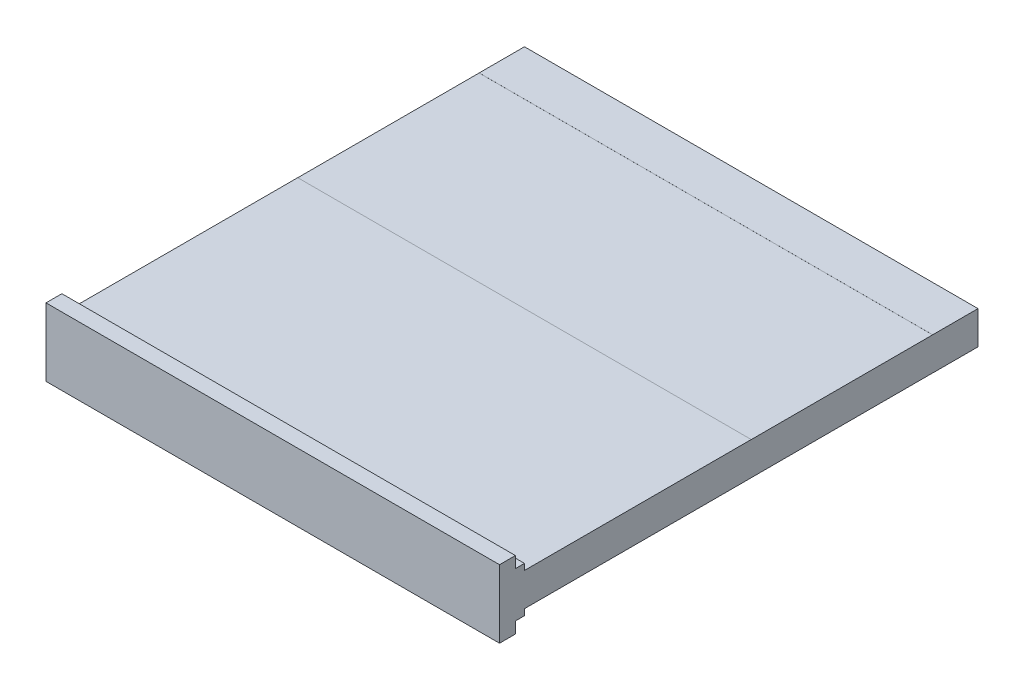
ISO-10303-21;
HEADER;
FILE_DESCRIPTION(('STEP AP214'),'2;1');
FILE_NAME('part.step','',(''),(''),'','','');
FILE_SCHEMA(('AUTOMOTIVE_DESIGN { 1 0 10303 214 1 1 1 1 }'));
ENDSEC;
DATA;
#1=APPLICATION_CONTEXT('core data for automotive mechanical design processes');
#2=APPLICATION_PROTOCOL_DEFINITION('international standard','automotive_design',2000,#1);
#3=PRODUCT_CONTEXT('',#1,'mechanical');
#4=PRODUCT('Part','Part','',(#3));
#5=PRODUCT_RELATED_PRODUCT_CATEGORY('part','',(#4));
#6=PRODUCT_DEFINITION_FORMATION('','',#4);
#7=PRODUCT_DEFINITION_CONTEXT('part definition',#1,'design');
#8=PRODUCT_DEFINITION('design','',#6,#7);
#9=PRODUCT_DEFINITION_SHAPE('','',#8);
#10=(LENGTH_UNIT() NAMED_UNIT(*) SI_UNIT(.MILLI.,.METRE.));
#11=(NAMED_UNIT(*) PLANE_ANGLE_UNIT() SI_UNIT($,.RADIAN.));
#12=(NAMED_UNIT(*) SI_UNIT($,.STERADIAN.) SOLID_ANGLE_UNIT());
#13=UNCERTAINTY_MEASURE_WITH_UNIT(LENGTH_MEASURE(1.E-05),#10,'distance_accuracy_value','');
#14=(GEOMETRIC_REPRESENTATION_CONTEXT(3) GLOBAL_UNCERTAINTY_ASSIGNED_CONTEXT((#13)) GLOBAL_UNIT_ASSIGNED_CONTEXT((#10,
#11,#12)) REPRESENTATION_CONTEXT('',''));
#15=CARTESIAN_POINT('',(0.,0.,0.));
#16=DIRECTION('',(0.,0.,1.));
#17=DIRECTION('',(1.,0.,0.));
#18=AXIS2_PLACEMENT_3D('',#15,#16,#17);
#19=CARTESIAN_POINT('',(0.,0.072865,1.));
#20=DIRECTION('',(0.,1.,0.));
#21=DIRECTION('',(0.,0.,1.));
#22=AXIS2_PLACEMENT_3D('',#19,#20,#21);
#23=PLANE('',#22);
#24=DIRECTION('',(0.,0.,-1.));
#25=VECTOR('',#24,1.);
#26=CARTESIAN_POINT('',(0.,0.072865,1.));
#27=LINE('',#26,#25);
#28=CARTESIAN_POINT('',(0.,0.072865,0.5));
#29=VERTEX_POINT('',#28);
#30=CARTESIAN_POINT('',(0.,0.072865,0.1));
#31=VERTEX_POINT('',#30);
#32=EDGE_CURVE('E43',#29,#31,#27,.T.);
#33=ORIENTED_EDGE('',*,*,#32,.F.);
#34=DIRECTION('',(-1.,0.,0.));
#35=VECTOR('',#34,1.);
#36=CARTESIAN_POINT('',(1.,0.072865,0.5));
#37=LINE('',#36,#35);
#38=CARTESIAN_POINT('',(1.,0.072865,0.5));
#39=VERTEX_POINT('',#38);
#40=EDGE_CURVE('E194',#39,#29,#37,.T.);
#41=ORIENTED_EDGE('',*,*,#40,.F.);
#42=DIRECTION('',(0.,0.,-1.));
#43=VECTOR('',#42,1.);
#44=CARTESIAN_POINT('',(1.,0.072865,1.));
#45=LINE('',#44,#43);
#46=CARTESIAN_POINT('',(1.,0.072865,0.1));
#47=VERTEX_POINT('',#46);
#48=EDGE_CURVE('E199',#39,#47,#45,.T.);
#49=ORIENTED_EDGE('',*,*,#48,.T.);
#50=DIRECTION('',(1.,0.,0.));
#51=VECTOR('',#50,1.);
#52=CARTESIAN_POINT('',(1.,0.072865,0.1));
#53=LINE('',#52,#51);
#54=EDGE_CURVE('E201',#31,#47,#53,.T.);
#55=ORIENTED_EDGE('',*,*,#54,.F.);
#56=EDGE_LOOP('',(#33,#41,#49,#55));
#57=FACE_BOUND('',#56,.T.);
#58=ADVANCED_FACE('F39',(#57),#23,.T.);
#59=CARTESIAN_POINT('',(0.,0.,1.));
#60=DIRECTION('',(0.,1.,0.));
#61=DIRECTION('',(0.,0.,1.));
#62=AXIS2_PLACEMENT_3D('',#59,#60,#61);
#63=PLANE('',#62);
#64=DIRECTION('',(1.,0.,0.));
#65=VECTOR('',#64,1.);
#66=CARTESIAN_POINT('',(0.,0.,0.5));
#67=LINE('',#66,#65);
#68=CARTESIAN_POINT('',(0.,0.,0.5));
#69=VERTEX_POINT('',#68);
#70=CARTESIAN_POINT('',(1.,0.,0.5));
#71=VERTEX_POINT('',#70);
#72=EDGE_CURVE('E231',#69,#71,#67,.T.);
#73=ORIENTED_EDGE('',*,*,#72,.F.);
#74=DIRECTION('',(0.,0.,-1.));
#75=VECTOR('',#74,1.);
#76=CARTESIAN_POINT('',(0.,0.,1.));
#77=LINE('',#76,#75);
#78=CARTESIAN_POINT('',(0.,0.,0.1));
#79=VERTEX_POINT('',#78);
#80=EDGE_CURVE('E11',#69,#79,#77,.T.);
#81=ORIENTED_EDGE('',*,*,#80,.T.);
#82=DIRECTION('',(-1.,0.,0.));
#83=VECTOR('',#82,1.);
#84=CARTESIAN_POINT('',(0.,0.,0.1));
#85=LINE('',#84,#83);
#86=CARTESIAN_POINT('',(1.,0.,0.1));
#87=VERTEX_POINT('',#86);
#88=EDGE_CURVE('E253',#87,#79,#85,.T.);
#89=ORIENTED_EDGE('',*,*,#88,.F.);
#90=DIRECTION('',(0.,0.,-1.));
#91=VECTOR('',#90,1.);
#92=CARTESIAN_POINT('',(1.,0.,1.));
#93=LINE('',#92,#91);
#94=EDGE_CURVE('E49',#71,#87,#93,.T.);
#95=ORIENTED_EDGE('',*,*,#94,.F.);
#96=EDGE_LOOP('',(#73,#81,#89,#95));
#97=FACE_BOUND('',#96,.T.);
#98=ADVANCED_FACE('F384',(#97),#63,.F.);
#99=CARTESIAN_POINT('',(0.,0.,1.));
#100=DIRECTION('',(-1.,0.,0.));
#101=DIRECTION('',(0.,0.,1.));
#102=AXIS2_PLACEMENT_3D('',#99,#100,#101);
#103=PLANE('',#102);
#104=DIRECTION('',(0.,-1.,0.));
#105=VECTOR('',#104,1.);
#106=CARTESIAN_POINT('',(0.,0.072965,0.5));
#107=LINE('',#106,#105);
#108=CARTESIAN_POINT('',(0.,0.072965,0.5));
#109=VERTEX_POINT('',#108);
#110=EDGE_CURVE('E184',#109,#29,#107,.T.);
#111=ORIENTED_EDGE('',*,*,#110,.T.);
#112=ORIENTED_EDGE('',*,*,#32,.T.);
#113=DIRECTION('',(0.,-1.,0.));
#114=VECTOR('',#113,1.);
#115=CARTESIAN_POINT('',(0.,0.072965,0.1));
#116=LINE('',#115,#114);
#117=CARTESIAN_POINT('',(0.,0.072965,0.1));
#118=VERTEX_POINT('',#117);
#119=EDGE_CURVE('E227',#118,#31,#116,.T.);
#120=ORIENTED_EDGE('',*,*,#119,.F.);
#121=DIRECTION('',(0.,0.,1.));
#122=VECTOR('',#121,1.);
#123=CARTESIAN_POINT('',(0.,0.072965,0.));
#124=LINE('',#123,#122);
#125=CARTESIAN_POINT('',(0.,0.072965,0.));
#126=VERTEX_POINT('',#125);
#127=EDGE_CURVE('E218',#126,#118,#124,.T.);
#128=ORIENTED_EDGE('',*,*,#127,.F.);
#129=DIRECTION('',(0.,1.,0.));
#130=VECTOR('',#129,1.);
#131=CARTESIAN_POINT('',(0.,0.,0.));
#132=LINE('',#131,#130);
#133=CARTESIAN_POINT('',(0.,-0.0001,0.));
#134=VERTEX_POINT('',#133);
#135=EDGE_CURVE('E364',#134,#126,#132,.T.);
#136=ORIENTED_EDGE('',*,*,#135,.F.);
#137=DIRECTION('',(0.,0.,-1.));
#138=VECTOR('',#137,1.);
#139=CARTESIAN_POINT('',(0.,-0.0001,0.));
#140=LINE('',#139,#138);
#141=CARTESIAN_POINT('',(0.,-0.0001,0.1));
#142=VERTEX_POINT('',#141);
#143=EDGE_CURVE('E254',#142,#134,#140,.T.);
#144=ORIENTED_EDGE('',*,*,#143,.F.);
#145=DIRECTION('',(0.,1.,0.));
#146=VECTOR('',#145,1.);
#147=CARTESIAN_POINT('',(0.,-0.0001,0.1));
#148=LINE('',#147,#146);
#149=EDGE_CURVE('E268',#142,#79,#148,.T.);
#150=ORIENTED_EDGE('',*,*,#149,.T.);
#151=ORIENTED_EDGE('',*,*,#80,.F.);
#152=DIRECTION('',(0.,1.,0.));
#153=VECTOR('',#152,1.);
#154=CARTESIAN_POINT('',(0.,-0.0001,0.5));
#155=LINE('',#154,#153);
#156=CARTESIAN_POINT('',(0.,-0.0001,0.5));
#157=VERTEX_POINT('',#156);
#158=EDGE_CURVE('E250',#157,#69,#155,.T.);
#159=ORIENTED_EDGE('',*,*,#158,.F.);
#160=DIRECTION('',(0.,0.,-1.));
#161=VECTOR('',#160,1.);
#162=CARTESIAN_POINT('',(0.,-0.0001,1.));
#163=LINE('',#162,#161);
#164=CARTESIAN_POINT('',(0.,-0.0001,1.));
#165=VERTEX_POINT('',#164);
#166=EDGE_CURVE('E232',#165,#157,#163,.T.);
#167=ORIENTED_EDGE('',*,*,#166,.F.);
#168=DIRECTION('',(0.,-1.,0.));
#169=VECTOR('',#168,1.);
#170=CARTESIAN_POINT('',(0.,0.0864325,1.));
#171=LINE('',#170,#169);
#172=CARTESIAN_POINT('',(0.,-0.0135675,1.));
#173=VERTEX_POINT('',#172);
#174=EDGE_CURVE('E324',#165,#173,#171,.T.);
#175=ORIENTED_EDGE('',*,*,#174,.T.);
#176=DIRECTION('',(0.,0.,-1.));
#177=VECTOR('',#176,1.);
#178=CARTESIAN_POINT('',(0.,-0.0135675,1.02));
#179=LINE('',#178,#177);
#180=CARTESIAN_POINT('',(0.,-0.0135675,1.02));
#181=VERTEX_POINT('',#180);
#182=EDGE_CURVE('E360',#181,#173,#179,.T.);
#183=ORIENTED_EDGE('',*,*,#182,.F.);
#184=DIRECTION('',(0.,-1.,0.));
#185=VECTOR('',#184,1.);
#186=CARTESIAN_POINT('',(0.,0.1114325,1.02));
#187=LINE('',#186,#185);
#188=CARTESIAN_POINT('',(0.,-0.0385675,1.02));
#189=VERTEX_POINT('',#188);
#190=EDGE_CURVE('E279',#181,#189,#187,.T.);
#191=ORIENTED_EDGE('',*,*,#190,.T.);
#192=DIRECTION('',(0.,0.,-1.));
#193=VECTOR('',#192,1.);
#194=CARTESIAN_POINT('',(0.,-0.0385675,1.055));
#195=LINE('',#194,#193);
#196=CARTESIAN_POINT('',(0.,-0.0385675,1.055));
#197=VERTEX_POINT('',#196);
#198=EDGE_CURVE('E320',#197,#189,#195,.T.);
#199=ORIENTED_EDGE('',*,*,#198,.F.);
#200=DIRECTION('',(0.,-1.,0.));
#201=VECTOR('',#200,1.);
#202=CARTESIAN_POINT('',(0.,0.1114325,1.055));
#203=LINE('',#202,#201);
#204=CARTESIAN_POINT('',(0.,0.1114325,1.055));
#205=VERTEX_POINT('',#204);
#206=EDGE_CURVE('E280',#205,#197,#203,.T.);
#207=ORIENTED_EDGE('',*,*,#206,.F.);
#208=DIRECTION('',(0.,0.,-1.));
#209=VECTOR('',#208,1.);
#210=CARTESIAN_POINT('',(0.,0.1114325,1.055));
#211=LINE('',#210,#209);
#212=CARTESIAN_POINT('',(0.,0.1114325,1.02));
#213=VERTEX_POINT('',#212);
#214=EDGE_CURVE('E294',#205,#213,#211,.T.);
#215=ORIENTED_EDGE('',*,*,#214,.T.);
#216=CARTESIAN_POINT('',(0.,0.0864325000000001,1.02));
#217=VERTEX_POINT('',#216);
#218=EDGE_CURVE('E295',#213,#217,#187,.T.);
#219=ORIENTED_EDGE('',*,*,#218,.T.);
#220=DIRECTION('',(0.,0.,-1.));
#221=VECTOR('',#220,1.);
#222=CARTESIAN_POINT('',(0.,0.0864325,1.02));
#223=LINE('',#222,#221);
#224=CARTESIAN_POINT('',(0.,0.0864325,1.));
#225=VERTEX_POINT('',#224);
#226=EDGE_CURVE('E334',#217,#225,#223,.T.);
#227=ORIENTED_EDGE('',*,*,#226,.T.);
#228=CARTESIAN_POINT('',(0.,0.072965,1.));
#229=VERTEX_POINT('',#228);
#230=EDGE_CURVE('E335',#225,#229,#171,.T.);
#231=ORIENTED_EDGE('',*,*,#230,.T.);
#232=DIRECTION('',(0.,0.,1.));
#233=VECTOR('',#232,1.);
#234=CARTESIAN_POINT('',(0.,0.072965,1.));
#235=LINE('',#234,#233);
#236=EDGE_CURVE('E57',#109,#229,#235,.T.);
#237=ORIENTED_EDGE('',*,*,#236,.F.);
#238=EDGE_LOOP('',(#111,#112,#120,#128,#136,#144,#150,#151,#159,#167,#175,#183,#191,#199,#207,
#215,#219,#227,#231,#237));
#239=FACE_BOUND('',#238,.T.);
#240=ADVANCED_FACE('F41',(#239),#103,.T.);
#241=CARTESIAN_POINT('',(1.,0.,1.));
#242=DIRECTION('',(-1.,0.,0.));
#243=DIRECTION('',(0.,0.,1.));
#244=AXIS2_PLACEMENT_3D('',#241,#242,#243);
#245=PLANE('',#244);
#246=ORIENTED_EDGE('',*,*,#48,.F.);
#247=DIRECTION('',(0.,-1.,0.));
#248=VECTOR('',#247,1.);
#249=CARTESIAN_POINT('',(1.,0.072965,0.5));
#250=LINE('',#249,#248);
#251=CARTESIAN_POINT('',(1.,0.072965,0.5));
#252=VERTEX_POINT('',#251);
#253=EDGE_CURVE('E181',#252,#39,#250,.T.);
#254=ORIENTED_EDGE('',*,*,#253,.F.);
#255=DIRECTION('',(0.,0.,-1.));
#256=VECTOR('',#255,1.);
#257=CARTESIAN_POINT('',(1.,0.072965,1.));
#258=LINE('',#257,#256);
#259=CARTESIAN_POINT('',(1.,0.072965,1.));
#260=VERTEX_POINT('',#259);
#261=EDGE_CURVE('E186',#260,#252,#258,.T.);
#262=ORIENTED_EDGE('',*,*,#261,.F.);
#263=DIRECTION('',(0.,1.,0.));
#264=VECTOR('',#263,1.);
#265=CARTESIAN_POINT('',(1.,0.0864325000000001,1.));
#266=LINE('',#265,#264);
#267=CARTESIAN_POINT('',(1.,0.0864325000000001,1.));
#268=VERTEX_POINT('',#267);
#269=EDGE_CURVE('E342',#260,#268,#266,.T.);
#270=ORIENTED_EDGE('',*,*,#269,.T.);
#271=DIRECTION('',(0.,0.,-1.));
#272=VECTOR('',#271,1.);
#273=CARTESIAN_POINT('',(1.,0.0864325000000001,1.02));
#274=LINE('',#273,#272);
#275=CARTESIAN_POINT('',(1.,0.0864325000000001,1.02));
#276=VERTEX_POINT('',#275);
#277=EDGE_CURVE('E352',#276,#268,#274,.T.);
#278=ORIENTED_EDGE('',*,*,#277,.F.);
#279=DIRECTION('',(0.,1.,0.));
#280=VECTOR('',#279,1.);
#281=CARTESIAN_POINT('',(1.,0.1114325,1.02));
#282=LINE('',#281,#280);
#283=CARTESIAN_POINT('',(1.,0.1114325,1.02));
#284=VERTEX_POINT('',#283);
#285=EDGE_CURVE('E302',#276,#284,#282,.T.);
#286=ORIENTED_EDGE('',*,*,#285,.T.);
#287=DIRECTION('',(0.,0.,-1.));
#288=VECTOR('',#287,1.);
#289=CARTESIAN_POINT('',(1.,0.1114325,1.055));
#290=LINE('',#289,#288);
#291=CARTESIAN_POINT('',(1.,0.1114325,1.055));
#292=VERTEX_POINT('',#291);
#293=EDGE_CURVE('E312',#292,#284,#290,.T.);
#294=ORIENTED_EDGE('',*,*,#293,.F.);
#295=DIRECTION('',(0.,1.,0.));
#296=VECTOR('',#295,1.);
#297=CARTESIAN_POINT('',(1.,0.1114325,1.055));
#298=LINE('',#297,#296);
#299=CARTESIAN_POINT('',(1.,-0.0385675,1.055));
#300=VERTEX_POINT('',#299);
#301=EDGE_CURVE('E288',#300,#292,#298,.T.);
#302=ORIENTED_EDGE('',*,*,#301,.F.);
#303=DIRECTION('',(0.,0.,-1.));
#304=VECTOR('',#303,1.);
#305=CARTESIAN_POINT('',(1.,-0.0385675,1.055));
#306=LINE('',#305,#304);
#307=CARTESIAN_POINT('',(1.,-0.0385675,1.02));
#308=VERTEX_POINT('',#307);
#309=EDGE_CURVE('E316',#300,#308,#306,.T.);
#310=ORIENTED_EDGE('',*,*,#309,.T.);
#311=CARTESIAN_POINT('',(1.,-0.0135674999999999,1.02));
#312=VERTEX_POINT('',#311);
#313=EDGE_CURVE('E303',#308,#312,#282,.T.);
#314=ORIENTED_EDGE('',*,*,#313,.T.);
#315=DIRECTION('',(0.,0.,-1.));
#316=VECTOR('',#315,1.);
#317=CARTESIAN_POINT('',(1.,-0.0135674999999999,1.02));
#318=LINE('',#317,#316);
#319=CARTESIAN_POINT('',(1.,-0.0135674999999999,1.));
#320=VERTEX_POINT('',#319);
#321=EDGE_CURVE('E356',#312,#320,#318,.T.);
#322=ORIENTED_EDGE('',*,*,#321,.T.);
#323=CARTESIAN_POINT('',(1.,-0.000100000000000002,1.));
#324=VERTEX_POINT('',#323);
#325=EDGE_CURVE('E343',#320,#324,#266,.T.);
#326=ORIENTED_EDGE('',*,*,#325,.T.);
#327=DIRECTION('',(0.,0.,1.));
#328=VECTOR('',#327,1.);
#329=CARTESIAN_POINT('',(1.,-0.0001,1.));
#330=LINE('',#329,#328);
#331=CARTESIAN_POINT('',(1.,-0.0001,0.5));
#332=VERTEX_POINT('',#331);
#333=EDGE_CURVE('E65',#332,#324,#330,.T.);
#334=ORIENTED_EDGE('',*,*,#333,.F.);
#335=DIRECTION('',(0.,1.,0.));
#336=VECTOR('',#335,1.);
#337=CARTESIAN_POINT('',(1.,-0.0001,0.5));
#338=LINE('',#337,#336);
#339=EDGE_CURVE('E244',#332,#71,#338,.T.);
#340=ORIENTED_EDGE('',*,*,#339,.T.);
#341=ORIENTED_EDGE('',*,*,#94,.T.);
#342=DIRECTION('',(0.,1.,0.));
#343=VECTOR('',#342,1.);
#344=CARTESIAN_POINT('',(1.,-0.0001,0.1));
#345=LINE('',#344,#343);
#346=CARTESIAN_POINT('',(1.,-0.0001,0.1));
#347=VERTEX_POINT('',#346);
#348=EDGE_CURVE('E275',#347,#87,#345,.T.);
#349=ORIENTED_EDGE('',*,*,#348,.F.);
#350=DIRECTION('',(0.,0.,1.));
#351=VECTOR('',#350,1.);
#352=CARTESIAN_POINT('',(1.,-0.0001,0.));
#353=LINE('',#352,#351);
#354=CARTESIAN_POINT('',(1.,-0.0001,0.));
#355=VERTEX_POINT('',#354);
#356=EDGE_CURVE('E262',#355,#347,#353,.T.);
#357=ORIENTED_EDGE('',*,*,#356,.F.);
#358=DIRECTION('',(0.,1.,0.));
#359=VECTOR('',#358,1.);
#360=CARTESIAN_POINT('',(1.,0.,0.));
#361=LINE('',#360,#359);
#362=CARTESIAN_POINT('',(1.,0.072965,0.));
#363=VERTEX_POINT('',#362);
#364=EDGE_CURVE('E367',#355,#363,#361,.T.);
#365=ORIENTED_EDGE('',*,*,#364,.T.);
#366=DIRECTION('',(0.,0.,-1.));
#367=VECTOR('',#366,1.);
#368=CARTESIAN_POINT('',(1.,0.072965,0.));
#369=LINE('',#368,#367);
#370=CARTESIAN_POINT('',(1.,0.072965,0.1));
#371=VERTEX_POINT('',#370);
#372=EDGE_CURVE('E206',#371,#363,#369,.T.);
#373=ORIENTED_EDGE('',*,*,#372,.F.);
#374=DIRECTION('',(0.,-1.,0.));
#375=VECTOR('',#374,1.);
#376=CARTESIAN_POINT('',(1.,0.072965,0.1));
#377=LINE('',#376,#375);
#378=EDGE_CURVE('E223',#371,#47,#377,.T.);
#379=ORIENTED_EDGE('',*,*,#378,.T.);
#380=EDGE_LOOP('',(#246,#254,#262,#270,#278,#286,#294,#302,#310,#314,#322,#326,#334,#340,#341,
#349,#357,#365,#373,#379));
#381=FACE_BOUND('',#380,.T.);
#382=ADVANCED_FACE('F197',(#381),#245,.F.);
#383=CARTESIAN_POINT('',(0.,0.,0.));
#384=DIRECTION('',(0.,0.,-1.));
#385=DIRECTION('',(-1.,0.,0.));
#386=AXIS2_PLACEMENT_3D('',#383,#384,#385);
#387=PLANE('',#386);
#388=ORIENTED_EDGE('',*,*,#135,.T.);
#389=DIRECTION('',(-1.,0.,0.));
#390=VECTOR('',#389,1.);
#391=CARTESIAN_POINT('',(1.,0.072965,0.));
#392=LINE('',#391,#390);
#393=EDGE_CURVE('E214',#363,#126,#392,.T.);
#394=ORIENTED_EDGE('',*,*,#393,.F.);
#395=ORIENTED_EDGE('',*,*,#364,.F.);
#396=DIRECTION('',(1.,0.,0.));
#397=VECTOR('',#396,1.);
#398=CARTESIAN_POINT('',(0.,-0.0001,0.));
#399=LINE('',#398,#397);
#400=EDGE_CURVE('E258',#134,#355,#399,.T.);
#401=ORIENTED_EDGE('',*,*,#400,.F.);
#402=EDGE_LOOP('',(#388,#394,#395,#401));
#403=FACE_BOUND('',#402,.T.);
#404=ADVANCED_FACE('F394',(#403),#387,.T.);
#405=CARTESIAN_POINT('',(0.,0.,1.));
#406=DIRECTION('',(0.,0.,1.));
#407=DIRECTION('',(1.,0.,0.));
#408=AXIS2_PLACEMENT_3D('',#405,#406,#407);
#409=PLANE('',#408);
#410=ORIENTED_EDGE('',*,*,#174,.F.);
#411=DIRECTION('',(-1.,0.,0.));
#412=VECTOR('',#411,1.);
#413=CARTESIAN_POINT('',(0.,-0.0001,1.));
#414=LINE('',#413,#412);
#415=EDGE_CURVE('E241',#324,#165,#414,.T.);
#416=ORIENTED_EDGE('',*,*,#415,.F.);
#417=ORIENTED_EDGE('',*,*,#325,.F.);
#418=DIRECTION('',(1.,0.,0.));
#419=VECTOR('',#418,1.);
#420=CARTESIAN_POINT('',(0.,-0.0135675,1.));
#421=LINE('',#420,#419);
#422=EDGE_CURVE('E339',#173,#320,#421,.T.);
#423=ORIENTED_EDGE('',*,*,#422,.F.);
#424=EDGE_LOOP('',(#410,#416,#417,#423));
#425=FACE_BOUND('',#424,.T.);
#426=ADVANCED_FACE('F398',(#425),#409,.F.);
#427=CARTESIAN_POINT('',(0.,-0.0135675,1.02));
#428=DIRECTION('',(0.,1.,0.));
#429=DIRECTION('',(-1.,0.,0.));
#430=AXIS2_PLACEMENT_3D('',#427,#428,#429);
#431=PLANE('',#430);
#432=ORIENTED_EDGE('',*,*,#422,.T.);
#433=ORIENTED_EDGE('',*,*,#321,.F.);
#434=DIRECTION('',(1.,0.,0.));
#435=VECTOR('',#434,1.);
#436=CARTESIAN_POINT('',(0.,-0.0135675,1.02));
#437=LINE('',#436,#435);
#438=EDGE_CURVE('E325',#181,#312,#437,.T.);
#439=ORIENTED_EDGE('',*,*,#438,.F.);
#440=ORIENTED_EDGE('',*,*,#182,.T.);
#441=EDGE_LOOP('',(#432,#433,#439,#440));
#442=FACE_BOUND('',#441,.T.);
#443=ADVANCED_FACE('F400',(#442),#431,.F.);
#444=CARTESIAN_POINT('',(0.,0.0864325,1.02));
#445=DIRECTION('',(0.,-1.,0.));
#446=DIRECTION('',(1.,0.,0.));
#447=AXIS2_PLACEMENT_3D('',#444,#445,#446);
#448=PLANE('',#447);
#449=DIRECTION('',(-1.,0.,0.));
#450=VECTOR('',#449,1.);
#451=CARTESIAN_POINT('',(0.,0.0864325,1.));
#452=LINE('',#451,#450);
#453=EDGE_CURVE('E330',#268,#225,#452,.T.);
#454=ORIENTED_EDGE('',*,*,#453,.T.);
#455=ORIENTED_EDGE('',*,*,#226,.F.);
#456=DIRECTION('',(-1.,0.,0.));
#457=VECTOR('',#456,1.);
#458=CARTESIAN_POINT('',(0.,0.0864325,1.02));
#459=LINE('',#458,#457);
#460=EDGE_CURVE('E329',#276,#217,#459,.T.);
#461=ORIENTED_EDGE('',*,*,#460,.F.);
#462=ORIENTED_EDGE('',*,*,#277,.T.);
#463=EDGE_LOOP('',(#454,#455,#461,#462));
#464=FACE_BOUND('',#463,.T.);
#465=ADVANCED_FACE('F403',(#464),#448,.F.);
#466=ORIENTED_EDGE('',*,*,#269,.F.);
#467=DIRECTION('',(1.,0.,0.));
#468=VECTOR('',#467,1.);
#469=CARTESIAN_POINT('',(1.,0.072965,1.));
#470=LINE('',#469,#468);
#471=EDGE_CURVE('E190',#229,#260,#470,.T.);
#472=ORIENTED_EDGE('',*,*,#471,.F.);
#473=ORIENTED_EDGE('',*,*,#230,.F.);
#474=ORIENTED_EDGE('',*,*,#453,.F.);
#475=EDGE_LOOP('',(#466,#472,#473,#474));
#476=FACE_BOUND('',#475,.T.);
#477=ADVANCED_FACE('F407',(#476),#409,.F.);
#478=CARTESIAN_POINT('',(0.,0.,1.02));
#479=DIRECTION('',(0.,0.,1.));
#480=DIRECTION('',(1.,0.,0.));
#481=AXIS2_PLACEMENT_3D('',#478,#479,#480);
#482=PLANE('',#481);
#483=ORIENTED_EDGE('',*,*,#190,.F.);
#484=ORIENTED_EDGE('',*,*,#438,.T.);
#485=ORIENTED_EDGE('',*,*,#313,.F.);
#486=DIRECTION('',(1.,0.,0.));
#487=VECTOR('',#486,1.);
#488=CARTESIAN_POINT('',(0.,-0.0385675,1.02));
#489=LINE('',#488,#487);
#490=EDGE_CURVE('E299',#189,#308,#489,.T.);
#491=ORIENTED_EDGE('',*,*,#490,.F.);
#492=EDGE_LOOP('',(#483,#484,#485,#491));
#493=FACE_BOUND('',#492,.T.);
#494=ADVANCED_FACE('F411',(#493),#482,.F.);
#495=ORIENTED_EDGE('',*,*,#285,.F.);
#496=ORIENTED_EDGE('',*,*,#460,.T.);
#497=ORIENTED_EDGE('',*,*,#218,.F.);
#498=DIRECTION('',(-1.,0.,0.));
#499=VECTOR('',#498,1.);
#500=CARTESIAN_POINT('',(0.,0.1114325,1.02));
#501=LINE('',#500,#499);
#502=EDGE_CURVE('E285',#284,#213,#501,.T.);
#503=ORIENTED_EDGE('',*,*,#502,.F.);
#504=EDGE_LOOP('',(#495,#496,#497,#503));
#505=FACE_BOUND('',#504,.T.);
#506=ADVANCED_FACE('F417',(#505),#482,.F.);
#507=CARTESIAN_POINT('',(0.,-0.0385675,1.055));
#508=DIRECTION('',(0.,1.,0.));
#509=DIRECTION('',(0.,0.,1.));
#510=AXIS2_PLACEMENT_3D('',#507,#508,#509);
#511=PLANE('',#510);
#512=ORIENTED_EDGE('',*,*,#490,.T.);
#513=ORIENTED_EDGE('',*,*,#309,.F.);
#514=DIRECTION('',(1.,0.,0.));
#515=VECTOR('',#514,1.);
#516=CARTESIAN_POINT('',(0.,-0.0385675,1.055));
#517=LINE('',#516,#515);
#518=EDGE_CURVE('E284',#197,#300,#517,.T.);
#519=ORIENTED_EDGE('',*,*,#518,.F.);
#520=ORIENTED_EDGE('',*,*,#198,.T.);
#521=EDGE_LOOP('',(#512,#513,#519,#520));
#522=FACE_BOUND('',#521,.T.);
#523=ADVANCED_FACE('F413',(#522),#511,.F.);
#524=CARTESIAN_POINT('',(0.,0.1114325,1.055));
#525=DIRECTION('',(0.,-1.,0.));
#526=DIRECTION('',(0.,0.,-1.));
#527=AXIS2_PLACEMENT_3D('',#524,#525,#526);
#528=PLANE('',#527);
#529=ORIENTED_EDGE('',*,*,#502,.T.);
#530=ORIENTED_EDGE('',*,*,#214,.F.);
#531=DIRECTION('',(-1.,0.,0.));
#532=VECTOR('',#531,1.);
#533=CARTESIAN_POINT('',(0.,0.1114325,1.055));
#534=LINE('',#533,#532);
#535=EDGE_CURVE('E291',#292,#205,#534,.T.);
#536=ORIENTED_EDGE('',*,*,#535,.F.);
#537=ORIENTED_EDGE('',*,*,#293,.T.);
#538=EDGE_LOOP('',(#529,#530,#536,#537));
#539=FACE_BOUND('',#538,.T.);
#540=ADVANCED_FACE('F416',(#539),#528,.F.);
#541=CARTESIAN_POINT('',(0.,0.,1.055));
#542=DIRECTION('',(0.,0.,1.));
#543=DIRECTION('',(1.,0.,0.));
#544=AXIS2_PLACEMENT_3D('',#541,#542,#543);
#545=PLANE('',#544);
#546=ORIENTED_EDGE('',*,*,#206,.T.);
#547=ORIENTED_EDGE('',*,*,#518,.T.);
#548=ORIENTED_EDGE('',*,*,#301,.T.);
#549=ORIENTED_EDGE('',*,*,#535,.T.);
#550=EDGE_LOOP('',(#546,#547,#548,#549));
#551=FACE_BOUND('',#550,.T.);
#552=ADVANCED_FACE('F421',(#551),#545,.T.);
#553=CARTESIAN_POINT('',(0.,-0.0001,0.1));
#554=DIRECTION('',(0.,0.,-1.));
#555=DIRECTION('',(-1.,0.,0.));
#556=AXIS2_PLACEMENT_3D('',#553,#554,#555);
#557=PLANE('',#556);
#558=ORIENTED_EDGE('',*,*,#88,.T.);
#559=ORIENTED_EDGE('',*,*,#149,.F.);
#560=DIRECTION('',(-1.,0.,0.));
#561=VECTOR('',#560,1.);
#562=CARTESIAN_POINT('',(0.,-0.0001,0.1));
#563=LINE('',#562,#561);
#564=EDGE_CURVE('E265',#347,#142,#563,.T.);
#565=ORIENTED_EDGE('',*,*,#564,.F.);
#566=ORIENTED_EDGE('',*,*,#348,.T.);
#567=EDGE_LOOP('',(#558,#559,#565,#566));
#568=FACE_BOUND('',#567,.T.);
#569=ADVANCED_FACE('F428',(#568),#557,.F.);
#570=CARTESIAN_POINT('',(0.,-0.0001,0.));
#571=DIRECTION('',(0.,1.,0.));
#572=DIRECTION('',(0.,0.,1.));
#573=AXIS2_PLACEMENT_3D('',#570,#571,#572);
#574=PLANE('',#573);
#575=ORIENTED_EDGE('',*,*,#143,.T.);
#576=ORIENTED_EDGE('',*,*,#400,.T.);
#577=ORIENTED_EDGE('',*,*,#356,.T.);
#578=ORIENTED_EDGE('',*,*,#564,.T.);
#579=EDGE_LOOP('',(#575,#576,#577,#578));
#580=FACE_BOUND('',#579,.T.);
#581=ADVANCED_FACE('F432',(#580),#574,.F.);
#582=CARTESIAN_POINT('',(0.,-0.0001,0.5));
#583=DIRECTION('',(0.,0.,1.));
#584=DIRECTION('',(1.,0.,0.));
#585=AXIS2_PLACEMENT_3D('',#582,#583,#584);
#586=PLANE('',#585);
#587=ORIENTED_EDGE('',*,*,#72,.T.);
#588=ORIENTED_EDGE('',*,*,#339,.F.);
#589=DIRECTION('',(1.,0.,0.));
#590=VECTOR('',#589,1.);
#591=CARTESIAN_POINT('',(0.,-0.0001,0.5));
#592=LINE('',#591,#590);
#593=EDGE_CURVE('E236',#157,#332,#592,.T.);
#594=ORIENTED_EDGE('',*,*,#593,.F.);
#595=ORIENTED_EDGE('',*,*,#158,.T.);
#596=EDGE_LOOP('',(#587,#588,#594,#595));
#597=FACE_BOUND('',#596,.T.);
#598=ADVANCED_FACE('F436',(#597),#586,.F.);
#599=CARTESIAN_POINT('',(0.,-0.0001,0.));
#600=DIRECTION('',(0.,-1.,0.));
#601=DIRECTION('',(0.,0.,-1.));
#602=AXIS2_PLACEMENT_3D('',#599,#600,#601);
#603=PLANE('',#602);
#604=ORIENTED_EDGE('',*,*,#166,.T.);
#605=ORIENTED_EDGE('',*,*,#593,.T.);
#606=ORIENTED_EDGE('',*,*,#333,.T.);
#607=ORIENTED_EDGE('',*,*,#415,.T.);
#608=EDGE_LOOP('',(#604,#605,#606,#607));
#609=FACE_BOUND('',#608,.T.);
#610=ADVANCED_FACE('F440',(#609),#603,.T.);
#611=CARTESIAN_POINT('',(1.,0.072965,0.1));
#612=DIRECTION('',(0.,0.,-1.));
#613=DIRECTION('',(-1.,0.,0.));
#614=AXIS2_PLACEMENT_3D('',#611,#612,#613);
#615=PLANE('',#614);
#616=ORIENTED_EDGE('',*,*,#54,.T.);
#617=ORIENTED_EDGE('',*,*,#378,.F.);
#618=DIRECTION('',(1.,0.,0.));
#619=VECTOR('',#618,1.);
#620=CARTESIAN_POINT('',(1.,0.072965,0.1));
#621=LINE('',#620,#619);
#622=EDGE_CURVE('E221',#118,#371,#621,.T.);
#623=ORIENTED_EDGE('',*,*,#622,.F.);
#624=ORIENTED_EDGE('',*,*,#119,.T.);
#625=EDGE_LOOP('',(#616,#617,#623,#624));
#626=FACE_BOUND('',#625,.T.);
#627=ADVANCED_FACE('F381',(#626),#615,.F.);
#628=CARTESIAN_POINT('',(0.,0.072965,0.));
#629=DIRECTION('',(0.,-1.,0.));
#630=DIRECTION('',(0.,0.,-1.));
#631=AXIS2_PLACEMENT_3D('',#628,#629,#630);
#632=PLANE('',#631);
#633=ORIENTED_EDGE('',*,*,#372,.T.);
#634=ORIENTED_EDGE('',*,*,#393,.T.);
#635=ORIENTED_EDGE('',*,*,#127,.T.);
#636=ORIENTED_EDGE('',*,*,#622,.T.);
#637=EDGE_LOOP('',(#633,#634,#635,#636));
#638=FACE_BOUND('',#637,.T.);
#639=ADVANCED_FACE('F446',(#638),#632,.F.);
#640=CARTESIAN_POINT('',(1.,0.072965,0.5));
#641=DIRECTION('',(0.,0.,1.));
#642=DIRECTION('',(1.,0.,0.));
#643=AXIS2_PLACEMENT_3D('',#640,#641,#642);
#644=PLANE('',#643);
#645=ORIENTED_EDGE('',*,*,#40,.T.);
#646=ORIENTED_EDGE('',*,*,#110,.F.);
#647=DIRECTION('',(-1.,0.,0.));
#648=VECTOR('',#647,1.);
#649=CARTESIAN_POINT('',(1.,0.072965,0.5));
#650=LINE('',#649,#648);
#651=EDGE_CURVE('E177',#252,#109,#650,.T.);
#652=ORIENTED_EDGE('',*,*,#651,.F.);
#653=ORIENTED_EDGE('',*,*,#253,.T.);
#654=EDGE_LOOP('',(#645,#646,#652,#653));
#655=FACE_BOUND('',#654,.T.);
#656=ADVANCED_FACE('F179',(#655),#644,.F.);
#657=CARTESIAN_POINT('',(0.,0.072965,0.));
#658=DIRECTION('',(0.,1.,0.));
#659=DIRECTION('',(0.,0.,1.));
#660=AXIS2_PLACEMENT_3D('',#657,#658,#659);
#661=PLANE('',#660);
#662=ORIENTED_EDGE('',*,*,#261,.T.);
#663=ORIENTED_EDGE('',*,*,#651,.T.);
#664=ORIENTED_EDGE('',*,*,#236,.T.);
#665=ORIENTED_EDGE('',*,*,#471,.T.);
#666=EDGE_LOOP('',(#662,#663,#664,#665));
#667=FACE_BOUND('',#666,.T.);
#668=ADVANCED_FACE('F189',(#667),#661,.T.);
#669=CLOSED_SHELL('',(#58,#98,#240,#382,#404,#426,#443,#465,#477,#494,#506,#523,#540,#552,#569,
#581,#598,#610,#627,#639,#656,#668));
#670=MANIFOLD_SOLID_BREP('B2',#669);
#671=ADVANCED_BREP_SHAPE_REPRESENTATION('',(#18,#670),#14);
#672=SHAPE_DEFINITION_REPRESENTATION(#9,#671);
ENDSEC;
END-ISO-10303-21;
